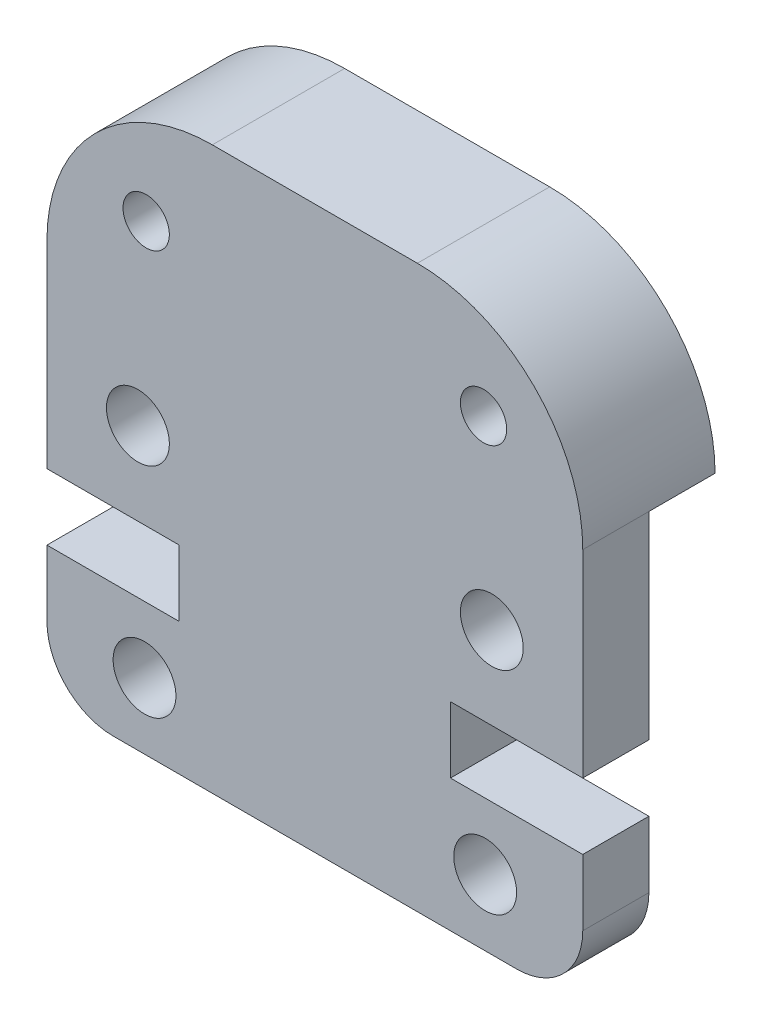
ISO-10303-21;
HEADER;
FILE_DESCRIPTION(('STEP AP214'),'2;1');
FILE_NAME('part.step','',(''),(''),'','','');
FILE_SCHEMA(('AUTOMOTIVE_DESIGN { 1 0 10303 214 1 1 1 1 }'));
ENDSEC;
DATA;
#1=APPLICATION_CONTEXT('core data for automotive mechanical design processes');
#2=APPLICATION_PROTOCOL_DEFINITION('international standard','automotive_design',2000,#1);
#3=PRODUCT_CONTEXT('',#1,'mechanical');
#4=PRODUCT('Part','Part','',(#3));
#5=PRODUCT_RELATED_PRODUCT_CATEGORY('part','',(#4));
#6=PRODUCT_DEFINITION_FORMATION('','',#4);
#7=PRODUCT_DEFINITION_CONTEXT('part definition',#1,'design');
#8=PRODUCT_DEFINITION('design','',#6,#7);
#9=PRODUCT_DEFINITION_SHAPE('','',#8);
#10=(LENGTH_UNIT() NAMED_UNIT(*) SI_UNIT(.MILLI.,.METRE.));
#11=(NAMED_UNIT(*) PLANE_ANGLE_UNIT() SI_UNIT($,.RADIAN.));
#12=(NAMED_UNIT(*) SI_UNIT($,.STERADIAN.) SOLID_ANGLE_UNIT());
#13=UNCERTAINTY_MEASURE_WITH_UNIT(LENGTH_MEASURE(1.E-05),#10,'distance_accuracy_value','');
#14=(GEOMETRIC_REPRESENTATION_CONTEXT(3) GLOBAL_UNCERTAINTY_ASSIGNED_CONTEXT((#13)) GLOBAL_UNIT_ASSIGNED_CONTEXT((#10,
#11,#12)) REPRESENTATION_CONTEXT('',''));
#15=CARTESIAN_POINT('',(0.,0.,0.));
#16=DIRECTION('',(0.,0.,1.));
#17=DIRECTION('',(1.,0.,0.));
#18=AXIS2_PLACEMENT_3D('',#15,#16,#17);
#19=CARTESIAN_POINT('',(-3.09999999999862,11.9799999999986,0.));
#20=DIRECTION('',(0.,0.,-1.));
#21=DIRECTION('',(-1.,0.,0.));
#22=AXIS2_PLACEMENT_3D('',#19,#20,#21);
#23=PLANE('',#22);
#24=CARTESIAN_POINT('',(-5.09999999999842,13.9799999999999,0.));
#25=DIRECTION('',(0.,0.,1.));
#26=DIRECTION('',(-1.,0.,0.));
#27=AXIS2_PLACEMENT_3D('',#24,#25,#26);
#28=CIRCLE('',#27,0.7);
#29=CARTESIAN_POINT('',(-5.79999999999843,13.9799999999999,0.));
#30=VERTEX_POINT('',#29);
#31=EDGE_CURVE('E276',#30,#30,#28,.T.);
#32=ORIENTED_EDGE('',*,*,#31,.T.);
#33=EDGE_LOOP('',(#32));
#34=FACE_BOUND('',#33,.T.);
#35=CARTESIAN_POINT('',(5.09999999999843,13.9799999999999,0.));
#36=DIRECTION('',(0.,0.,1.));
#37=DIRECTION('',(1.,0.,0.));
#38=AXIS2_PLACEMENT_3D('',#35,#36,#37);
#39=CIRCLE('',#38,0.699999999999999);
#40=CARTESIAN_POINT('',(5.79999999999843,13.9799999999999,0.));
#41=VERTEX_POINT('',#40);
#42=EDGE_CURVE('E264',#41,#41,#39,.T.);
#43=ORIENTED_EDGE('',*,*,#42,.T.);
#44=EDGE_LOOP('',(#43));
#45=FACE_BOUND('',#44,.T.);
#46=CARTESIAN_POINT('',(3.09999999999862,11.9799999999986,0.));
#47=DIRECTION('',(0.,0.,1.));
#48=DIRECTION('',(1.,0.,0.));
#49=AXIS2_PLACEMENT_3D('',#46,#47,#48);
#50=CIRCLE('',#49,5.00000000000135);
#51=CARTESIAN_POINT('',(8.09999999999997,11.9799999999986,0.));
#52=VERTEX_POINT('',#51);
#53=CARTESIAN_POINT('',(3.09999999999862,16.98,0.));
#54=VERTEX_POINT('',#53);
#55=EDGE_CURVE('E68',#52,#54,#50,.T.);
#56=ORIENTED_EDGE('',*,*,#55,.F.);
#57=DIRECTION('',(-1.,0.,0.));
#58=VECTOR('',#57,1.);
#59=CARTESIAN_POINT('',(8.09999999999997,11.9799999999986,0.));
#60=LINE('',#59,#58);
#61=CARTESIAN_POINT('',(-8.09999999999997,11.9799999999986,0.));
#62=VERTEX_POINT('',#61);
#63=EDGE_CURVE('E216',#52,#62,#60,.T.);
#64=ORIENTED_EDGE('',*,*,#63,.T.);
#65=CARTESIAN_POINT('',(-3.09999999999862,11.9799999999986,0.));
#66=DIRECTION('',(0.,0.,1.));
#67=DIRECTION('',(-1.,0.,0.));
#68=AXIS2_PLACEMENT_3D('',#65,#66,#67);
#69=CIRCLE('',#68,5.00000000000136);
#70=CARTESIAN_POINT('',(-3.09999999999862,16.98,0.));
#71=VERTEX_POINT('',#70);
#72=EDGE_CURVE('E149',#71,#62,#69,.T.);
#73=ORIENTED_EDGE('',*,*,#72,.F.);
#74=DIRECTION('',(-1.,0.,0.));
#75=VECTOR('',#74,1.);
#76=CARTESIAN_POINT('',(3.09999999999862,16.98,0.));
#77=LINE('',#76,#75);
#78=EDGE_CURVE('E74',#54,#71,#77,.T.);
#79=ORIENTED_EDGE('',*,*,#78,.F.);
#80=EDGE_LOOP('',(#56,#64,#73,#79));
#81=FACE_BOUND('',#80,.T.);
#82=ADVANCED_FACE('F35',(#34,#45,#81),#23,.T.);
#83=CARTESIAN_POINT('',(-3.09999999999862,11.9799999999986,4.));
#84=DIRECTION('',(0.,0.,-1.));
#85=DIRECTION('',(-1.,0.,0.));
#86=AXIS2_PLACEMENT_3D('',#83,#84,#85);
#87=PLANE('',#86);
#88=CARTESIAN_POINT('',(5.09999999999843,13.9799999999999,4.));
#89=DIRECTION('',(0.,0.,1.));
#90=DIRECTION('',(1.,0.,0.));
#91=AXIS2_PLACEMENT_3D('',#88,#89,#90);
#92=CIRCLE('',#91,0.699999999999999);
#93=CARTESIAN_POINT('',(5.79999999999843,13.9799999999999,4.));
#94=VERTEX_POINT('',#93);
#95=EDGE_CURVE('E265',#94,#94,#92,.T.);
#96=ORIENTED_EDGE('',*,*,#95,.F.);
#97=EDGE_LOOP('',(#96));
#98=FACE_BOUND('',#97,.T.);
#99=CARTESIAN_POINT('',(-5.34999999999997,8.50000000000221,4.));
#100=DIRECTION('',(0.,0.,1.));
#101=DIRECTION('',(-1.,0.,0.));
#102=AXIS2_PLACEMENT_3D('',#99,#100,#101);
#103=CIRCLE('',#102,0.95);
#104=CARTESIAN_POINT('',(-6.29999999999997,8.50000000000221,4.));
#105=VERTEX_POINT('',#104);
#106=EDGE_CURVE('E273',#105,#105,#103,.T.);
#107=ORIENTED_EDGE('',*,*,#106,.F.);
#108=EDGE_LOOP('',(#107));
#109=FACE_BOUND('',#108,.T.);
#110=CARTESIAN_POINT('',(-5.15,1.99999999999997,4.));
#111=DIRECTION('',(0.,0.,1.));
#112=DIRECTION('',(-1.,0.,0.));
#113=AXIS2_PLACEMENT_3D('',#110,#111,#112);
#114=CIRCLE('',#113,0.95);
#115=CARTESIAN_POINT('',(-6.1,1.99999999999997,4.));
#116=VERTEX_POINT('',#115);
#117=EDGE_CURVE('E152',#116,#116,#114,.T.);
#118=ORIENTED_EDGE('',*,*,#117,.F.);
#119=EDGE_LOOP('',(#118));
#120=FACE_BOUND('',#119,.T.);
#121=CARTESIAN_POINT('',(-3.09999999999862,11.9799999999986,4.));
#122=DIRECTION('',(0.,0.,1.));
#123=DIRECTION('',(-1.,0.,0.));
#124=AXIS2_PLACEMENT_3D('',#121,#122,#123);
#125=CIRCLE('',#124,5.00000000000136);
#126=CARTESIAN_POINT('',(-3.09999999999862,16.98,4.));
#127=VERTEX_POINT('',#126);
#128=CARTESIAN_POINT('',(-8.09999999999997,11.9799999999986,4.));
#129=VERTEX_POINT('',#128);
#130=EDGE_CURVE('E155',#127,#129,#125,.T.);
#131=ORIENTED_EDGE('',*,*,#130,.T.);
#132=DIRECTION('',(0.,-1.,0.));
#133=VECTOR('',#132,1.);
#134=CARTESIAN_POINT('',(-8.09999999999997,11.9799999999986,4.));
#135=LINE('',#134,#133);
#136=CARTESIAN_POINT('',(-8.09999999999997,5.99999999999993,4.));
#137=VERTEX_POINT('',#136);
#138=EDGE_CURVE('E82',#129,#137,#135,.T.);
#139=ORIENTED_EDGE('',*,*,#138,.T.);
#140=DIRECTION('',(1.,0.,0.));
#141=VECTOR('',#140,1.);
#142=CARTESIAN_POINT('',(-8.09999999999997,5.99999999999993,4.));
#143=LINE('',#142,#141);
#144=CARTESIAN_POINT('',(-4.10000000000002,5.99999999999993,4.));
#145=VERTEX_POINT('',#144);
#146=EDGE_CURVE('E198',#137,#145,#143,.T.);
#147=ORIENTED_EDGE('',*,*,#146,.T.);
#148=DIRECTION('',(0.,-1.,0.));
#149=VECTOR('',#148,1.);
#150=CARTESIAN_POINT('',(-4.10000000000002,5.99999999999993,4.));
#151=LINE('',#150,#149);
#152=CARTESIAN_POINT('',(-4.10000000000002,3.99999999999995,4.));
#153=VERTEX_POINT('',#152);
#154=EDGE_CURVE('E287',#145,#153,#151,.T.);
#155=ORIENTED_EDGE('',*,*,#154,.T.);
#156=DIRECTION('',(-1.,0.,0.));
#157=VECTOR('',#156,1.);
#158=CARTESIAN_POINT('',(-4.10000000000002,3.99999999999995,4.));
#159=LINE('',#158,#157);
#160=CARTESIAN_POINT('',(-8.09999999999997,3.99999999999995,4.));
#161=VERTEX_POINT('',#160);
#162=EDGE_CURVE('E289',#153,#161,#159,.T.);
#163=ORIENTED_EDGE('',*,*,#162,.T.);
#164=DIRECTION('',(0.,-1.,0.));
#165=VECTOR('',#164,1.);
#166=CARTESIAN_POINT('',(-8.09999999999997,1.99999999999997,4.));
#167=LINE('',#166,#165);
#168=CARTESIAN_POINT('',(-8.09999999999997,1.99999999999997,4.));
#169=VERTEX_POINT('',#168);
#170=EDGE_CURVE('E291',#161,#169,#167,.T.);
#171=ORIENTED_EDGE('',*,*,#170,.T.);
#172=CARTESIAN_POINT('',(-6.1,1.99999999999997,4.));
#173=DIRECTION('',(0.,0.,1.));
#174=DIRECTION('',(-1.,0.,0.));
#175=AXIS2_PLACEMENT_3D('',#172,#173,#174);
#176=CIRCLE('',#175,1.99999999999998);
#177=CARTESIAN_POINT('',(-6.09999999999999,0.,4.));
#178=VERTEX_POINT('',#177);
#179=EDGE_CURVE('E293',#169,#178,#176,.T.);
#180=ORIENTED_EDGE('',*,*,#179,.T.);
#181=DIRECTION('',(1.,0.,0.));
#182=VECTOR('',#181,1.);
#183=CARTESIAN_POINT('',(6.1,0.,4.));
#184=LINE('',#183,#182);
#185=CARTESIAN_POINT('',(6.1,0.,4.));
#186=VERTEX_POINT('',#185);
#187=EDGE_CURVE('E295',#178,#186,#184,.T.);
#188=ORIENTED_EDGE('',*,*,#187,.T.);
#189=CARTESIAN_POINT('',(6.1,1.99999999999998,4.));
#190=DIRECTION('',(0.,0.,1.));
#191=DIRECTION('',(1.,0.,0.));
#192=AXIS2_PLACEMENT_3D('',#189,#190,#191);
#193=CIRCLE('',#192,1.99999999999998);
#194=CARTESIAN_POINT('',(8.09999999999997,1.99999999999998,4.));
#195=VERTEX_POINT('',#194);
#196=EDGE_CURVE('E297',#186,#195,#193,.T.);
#197=ORIENTED_EDGE('',*,*,#196,.T.);
#198=DIRECTION('',(0.,1.,0.));
#199=VECTOR('',#198,1.);
#200=CARTESIAN_POINT('',(8.09999999999997,1.99999999999998,4.));
#201=LINE('',#200,#199);
#202=CARTESIAN_POINT('',(8.09999999999997,3.99999999999995,4.));
#203=VERTEX_POINT('',#202);
#204=EDGE_CURVE('E299',#195,#203,#201,.T.);
#205=ORIENTED_EDGE('',*,*,#204,.T.);
#206=DIRECTION('',(-1.,0.,0.));
#207=VECTOR('',#206,1.);
#208=CARTESIAN_POINT('',(4.10000000000002,3.99999999999995,4.));
#209=LINE('',#208,#207);
#210=CARTESIAN_POINT('',(4.10000000000002,3.99999999999995,4.));
#211=VERTEX_POINT('',#210);
#212=EDGE_CURVE('E301',#203,#211,#209,.T.);
#213=ORIENTED_EDGE('',*,*,#212,.T.);
#214=DIRECTION('',(0.,1.,0.));
#215=VECTOR('',#214,1.);
#216=CARTESIAN_POINT('',(4.10000000000002,5.99999999999993,4.));
#217=LINE('',#216,#215);
#218=CARTESIAN_POINT('',(4.10000000000002,5.99999999999993,4.));
#219=VERTEX_POINT('',#218);
#220=EDGE_CURVE('E303',#211,#219,#217,.T.);
#221=ORIENTED_EDGE('',*,*,#220,.T.);
#222=DIRECTION('',(1.,0.,0.));
#223=VECTOR('',#222,1.);
#224=CARTESIAN_POINT('',(8.09999999999997,5.99999999999993,4.));
#225=LINE('',#224,#223);
#226=CARTESIAN_POINT('',(8.09999999999997,5.99999999999993,4.));
#227=VERTEX_POINT('',#226);
#228=EDGE_CURVE('E128',#219,#227,#225,.T.);
#229=ORIENTED_EDGE('',*,*,#228,.T.);
#230=DIRECTION('',(0.,1.,0.));
#231=VECTOR('',#230,1.);
#232=CARTESIAN_POINT('',(8.09999999999997,11.9799999999986,4.));
#233=LINE('',#232,#231);
#234=CARTESIAN_POINT('',(8.09999999999997,11.9799999999986,4.));
#235=VERTEX_POINT('',#234);
#236=EDGE_CURVE('E121',#227,#235,#233,.T.);
#237=ORIENTED_EDGE('',*,*,#236,.T.);
#238=CARTESIAN_POINT('',(3.09999999999862,11.9799999999986,4.));
#239=DIRECTION('',(0.,0.,1.));
#240=DIRECTION('',(1.,0.,0.));
#241=AXIS2_PLACEMENT_3D('',#238,#239,#240);
#242=CIRCLE('',#241,5.00000000000135);
#243=CARTESIAN_POINT('',(3.09999999999862,16.98,4.));
#244=VERTEX_POINT('',#243);
#245=EDGE_CURVE('E126',#235,#244,#242,.T.);
#246=ORIENTED_EDGE('',*,*,#245,.T.);
#247=DIRECTION('',(-1.,0.,0.));
#248=VECTOR('',#247,1.);
#249=CARTESIAN_POINT('',(3.09999999999862,16.98,4.));
#250=LINE('',#249,#248);
#251=EDGE_CURVE('E53',#244,#127,#250,.T.);
#252=ORIENTED_EDGE('',*,*,#251,.T.);
#253=EDGE_LOOP('',(#131,#139,#147,#155,#163,#171,#180,#188,#197,#205,#213,#221,#229,#237,#246,#252));
#254=FACE_BOUND('',#253,.T.);
#255=CARTESIAN_POINT('',(-5.09999999999842,13.9799999999999,4.));
#256=DIRECTION('',(0.,0.,1.));
#257=DIRECTION('',(-1.,0.,0.));
#258=AXIS2_PLACEMENT_3D('',#255,#256,#257);
#259=CIRCLE('',#258,0.7);
#260=CARTESIAN_POINT('',(-5.79999999999843,13.9799999999999,4.));
#261=VERTEX_POINT('',#260);
#262=EDGE_CURVE('E277',#261,#261,#259,.T.);
#263=ORIENTED_EDGE('',*,*,#262,.F.);
#264=EDGE_LOOP('',(#263));
#265=FACE_BOUND('',#264,.T.);
#266=CARTESIAN_POINT('',(5.34999999999998,8.50000000000221,4.));
#267=DIRECTION('',(0.,0.,1.));
#268=DIRECTION('',(1.,0.,0.));
#269=AXIS2_PLACEMENT_3D('',#266,#267,#268);
#270=CIRCLE('',#269,0.95);
#271=CARTESIAN_POINT('',(6.29999999999998,8.50000000000221,4.));
#272=VERTEX_POINT('',#271);
#273=EDGE_CURVE('E268',#272,#272,#270,.T.);
#274=ORIENTED_EDGE('',*,*,#273,.F.);
#275=EDGE_LOOP('',(#274));
#276=FACE_BOUND('',#275,.T.);
#277=CARTESIAN_POINT('',(5.15,1.99999999999998,4.));
#278=DIRECTION('',(0.,0.,1.));
#279=DIRECTION('',(1.,0.,0.));
#280=AXIS2_PLACEMENT_3D('',#277,#278,#279);
#281=CIRCLE('',#280,0.95);
#282=CARTESIAN_POINT('',(6.1,1.99999999999998,4.));
#283=VERTEX_POINT('',#282);
#284=EDGE_CURVE('E261',#283,#283,#281,.T.);
#285=ORIENTED_EDGE('',*,*,#284,.F.);
#286=EDGE_LOOP('',(#285));
#287=FACE_BOUND('',#286,.T.);
#288=ADVANCED_FACE('F123',(#98,#109,#120,#254,#265,#276,#287),#87,.F.);
#289=CARTESIAN_POINT('',(-3.09999999999862,11.9799999999986,4.));
#290=DIRECTION('',(0.,0.,-1.));
#291=DIRECTION('',(-1.,0.,0.));
#292=AXIS2_PLACEMENT_3D('',#289,#290,#291);
#293=CYLINDRICAL_SURFACE('',#292,5.00000000000136);
#294=ORIENTED_EDGE('',*,*,#72,.T.);
#295=DIRECTION('',(0.,0.,-1.));
#296=VECTOR('',#295,1.);
#297=CARTESIAN_POINT('',(-8.09999999999997,11.9799999999986,2.));
#298=LINE('',#297,#296);
#299=CARTESIAN_POINT('',(-8.09999999999997,11.9799999999986,2.));
#300=VERTEX_POINT('',#299);
#301=EDGE_CURVE('E223',#300,#62,#298,.T.);
#302=ORIENTED_EDGE('',*,*,#301,.F.);
#303=DIRECTION('',(0.,0.,-1.));
#304=VECTOR('',#303,1.);
#305=CARTESIAN_POINT('',(-8.09999999999997,11.9799999999986,4.));
#306=LINE('',#305,#304);
#307=EDGE_CURVE('E11',#129,#300,#306,.T.);
#308=ORIENTED_EDGE('',*,*,#307,.F.);
#309=ORIENTED_EDGE('',*,*,#130,.F.);
#310=DIRECTION('',(0.,0.,-1.));
#311=VECTOR('',#310,1.);
#312=CARTESIAN_POINT('',(-3.09999999999862,16.98,4.));
#313=LINE('',#312,#311);
#314=EDGE_CURVE('E145',#127,#71,#313,.T.);
#315=ORIENTED_EDGE('',*,*,#314,.T.);
#316=EDGE_LOOP('',(#294,#302,#308,#309,#315));
#317=FACE_BOUND('',#316,.T.);
#318=ADVANCED_FACE('F37',(#317),#293,.T.);
#319=CARTESIAN_POINT('',(-8.09999999999997,11.9799999999986,4.));
#320=DIRECTION('',(1.,0.,0.));
#321=DIRECTION('',(0.,1.,0.));
#322=AXIS2_PLACEMENT_3D('',#319,#320,#321);
#323=PLANE('',#322);
#324=ORIENTED_EDGE('',*,*,#307,.T.);
#325=DIRECTION('',(0.,-1.,0.));
#326=VECTOR('',#325,1.);
#327=CARTESIAN_POINT('',(-8.09999999999997,11.9799999999986,2.));
#328=LINE('',#327,#326);
#329=CARTESIAN_POINT('',(-8.09999999999997,5.99999999999993,2.));
#330=VERTEX_POINT('',#329);
#331=EDGE_CURVE('E205',#300,#330,#328,.T.);
#332=ORIENTED_EDGE('',*,*,#331,.T.);
#333=DIRECTION('',(0.,0.,-1.));
#334=VECTOR('',#333,1.);
#335=CARTESIAN_POINT('',(-8.09999999999997,5.99999999999993,4.));
#336=LINE('',#335,#334);
#337=EDGE_CURVE('E45',#137,#330,#336,.T.);
#338=ORIENTED_EDGE('',*,*,#337,.F.);
#339=ORIENTED_EDGE('',*,*,#138,.F.);
#340=EDGE_LOOP('',(#324,#332,#338,#339));
#341=FACE_BOUND('',#340,.T.);
#342=ADVANCED_FACE('F203',(#341),#323,.F.);
#343=CARTESIAN_POINT('',(-8.09999999999997,5.99999999999993,4.));
#344=DIRECTION('',(0.,1.,0.));
#345=DIRECTION('',(-1.,0.,0.));
#346=AXIS2_PLACEMENT_3D('',#343,#344,#345);
#347=PLANE('',#346);
#348=ORIENTED_EDGE('',*,*,#337,.T.);
#349=DIRECTION('',(1.,0.,0.));
#350=VECTOR('',#349,1.);
#351=CARTESIAN_POINT('',(-8.09999999999997,5.99999999999993,2.));
#352=LINE('',#351,#350);
#353=CARTESIAN_POINT('',(-4.10000000000002,5.99999999999993,2.));
#354=VERTEX_POINT('',#353);
#355=EDGE_CURVE('E197',#330,#354,#352,.T.);
#356=ORIENTED_EDGE('',*,*,#355,.T.);
#357=DIRECTION('',(0.,0.,-1.));
#358=VECTOR('',#357,1.);
#359=CARTESIAN_POINT('',(-4.10000000000002,5.99999999999993,4.));
#360=LINE('',#359,#358);
#361=EDGE_CURVE('E186',#145,#354,#360,.T.);
#362=ORIENTED_EDGE('',*,*,#361,.F.);
#363=ORIENTED_EDGE('',*,*,#146,.F.);
#364=EDGE_LOOP('',(#348,#356,#362,#363));
#365=FACE_BOUND('',#364,.T.);
#366=ADVANCED_FACE('F194',(#365),#347,.F.);
#367=CARTESIAN_POINT('',(-4.10000000000002,5.99999999999993,4.));
#368=DIRECTION('',(1.,0.,0.));
#369=DIRECTION('',(0.,0.,-1.));
#370=AXIS2_PLACEMENT_3D('',#367,#368,#369);
#371=PLANE('',#370);
#372=ORIENTED_EDGE('',*,*,#361,.T.);
#373=DIRECTION('',(0.,-1.,0.));
#374=VECTOR('',#373,1.);
#375=CARTESIAN_POINT('',(-4.10000000000002,5.99999999999993,2.));
#376=LINE('',#375,#374);
#377=CARTESIAN_POINT('',(-4.10000000000002,3.99999999999995,2.));
#378=VERTEX_POINT('',#377);
#379=EDGE_CURVE('E257',#354,#378,#376,.T.);
#380=ORIENTED_EDGE('',*,*,#379,.T.);
#381=DIRECTION('',(0.,0.,-1.));
#382=VECTOR('',#381,1.);
#383=CARTESIAN_POINT('',(-4.10000000000002,3.99999999999995,4.));
#384=LINE('',#383,#382);
#385=EDGE_CURVE('E183',#153,#378,#384,.T.);
#386=ORIENTED_EDGE('',*,*,#385,.F.);
#387=ORIENTED_EDGE('',*,*,#154,.F.);
#388=EDGE_LOOP('',(#372,#380,#386,#387));
#389=FACE_BOUND('',#388,.T.);
#390=ADVANCED_FACE('F332',(#389),#371,.F.);
#391=CARTESIAN_POINT('',(-4.10000000000002,3.99999999999995,4.));
#392=DIRECTION('',(0.,-1.,0.));
#393=DIRECTION('',(1.,0.,0.));
#394=AXIS2_PLACEMENT_3D('',#391,#392,#393);
#395=PLANE('',#394);
#396=ORIENTED_EDGE('',*,*,#385,.T.);
#397=DIRECTION('',(-1.,0.,0.));
#398=VECTOR('',#397,1.);
#399=CARTESIAN_POINT('',(-4.10000000000002,3.99999999999995,2.));
#400=LINE('',#399,#398);
#401=CARTESIAN_POINT('',(-8.09999999999997,3.99999999999995,2.));
#402=VERTEX_POINT('',#401);
#403=EDGE_CURVE('E254',#378,#402,#400,.T.);
#404=ORIENTED_EDGE('',*,*,#403,.T.);
#405=DIRECTION('',(0.,0.,-1.));
#406=VECTOR('',#405,1.);
#407=CARTESIAN_POINT('',(-8.09999999999997,3.99999999999995,4.));
#408=LINE('',#407,#406);
#409=EDGE_CURVE('E180',#161,#402,#408,.T.);
#410=ORIENTED_EDGE('',*,*,#409,.F.);
#411=ORIENTED_EDGE('',*,*,#162,.F.);
#412=EDGE_LOOP('',(#396,#404,#410,#411));
#413=FACE_BOUND('',#412,.T.);
#414=ADVANCED_FACE('F336',(#413),#395,.F.);
#415=CARTESIAN_POINT('',(-8.09999999999997,1.99999999999997,4.));
#416=DIRECTION('',(1.,0.,0.));
#417=DIRECTION('',(0.,0.,-1.));
#418=AXIS2_PLACEMENT_3D('',#415,#416,#417);
#419=PLANE('',#418);
#420=ORIENTED_EDGE('',*,*,#409,.T.);
#421=CARTESIAN_POINT('',(-8.09999999999997,1.99999999999997,2.));
#422=VERTEX_POINT('',#421);
#423=EDGE_CURVE('E211',#402,#422,#328,.T.);
#424=ORIENTED_EDGE('',*,*,#423,.T.);
#425=DIRECTION('',(0.,0.,-1.));
#426=VECTOR('',#425,1.);
#427=CARTESIAN_POINT('',(-8.09999999999997,1.99999999999997,4.));
#428=LINE('',#427,#426);
#429=EDGE_CURVE('E177',#169,#422,#428,.T.);
#430=ORIENTED_EDGE('',*,*,#429,.F.);
#431=ORIENTED_EDGE('',*,*,#170,.F.);
#432=EDGE_LOOP('',(#420,#424,#430,#431));
#433=FACE_BOUND('',#432,.T.);
#434=ADVANCED_FACE('F392',(#433),#419,.F.);
#435=CARTESIAN_POINT('',(-6.1,1.99999999999997,4.));
#436=DIRECTION('',(0.,0.,-1.));
#437=DIRECTION('',(-1.,0.,0.));
#438=AXIS2_PLACEMENT_3D('',#435,#436,#437);
#439=CYLINDRICAL_SURFACE('',#438,1.99999999999998);
#440=ORIENTED_EDGE('',*,*,#429,.T.);
#441=CARTESIAN_POINT('',(-6.1,1.99999999999997,2.));
#442=DIRECTION('',(0.,0.,1.));
#443=DIRECTION('',(1.,0.,0.));
#444=AXIS2_PLACEMENT_3D('',#441,#442,#443);
#445=CIRCLE('',#444,1.99999999999998);
#446=CARTESIAN_POINT('',(-6.09999999999999,0.,2.));
#447=VERTEX_POINT('',#446);
#448=EDGE_CURVE('E251',#422,#447,#445,.T.);
#449=ORIENTED_EDGE('',*,*,#448,.T.);
#450=DIRECTION('',(0.,0.,-1.));
#451=VECTOR('',#450,1.);
#452=CARTESIAN_POINT('',(-6.09999999999999,0.,4.));
#453=LINE('',#452,#451);
#454=EDGE_CURVE('E174',#178,#447,#453,.T.);
#455=ORIENTED_EDGE('',*,*,#454,.F.);
#456=ORIENTED_EDGE('',*,*,#179,.F.);
#457=EDGE_LOOP('',(#440,#449,#455,#456));
#458=FACE_BOUND('',#457,.T.);
#459=ADVANCED_FACE('F388',(#458),#439,.T.);
#460=CARTESIAN_POINT('',(6.1,0.,4.));
#461=DIRECTION('',(0.,1.,0.));
#462=DIRECTION('',(-1.,0.,0.));
#463=AXIS2_PLACEMENT_3D('',#460,#461,#462);
#464=PLANE('',#463);
#465=ORIENTED_EDGE('',*,*,#454,.T.);
#466=DIRECTION('',(1.,0.,0.));
#467=VECTOR('',#466,1.);
#468=CARTESIAN_POINT('',(-8.09999999999997,0.,2.));
#469=LINE('',#468,#467);
#470=CARTESIAN_POINT('',(6.1,0.,2.));
#471=VERTEX_POINT('',#470);
#472=EDGE_CURVE('E210',#447,#471,#469,.T.);
#473=ORIENTED_EDGE('',*,*,#472,.T.);
#474=DIRECTION('',(0.,0.,-1.));
#475=VECTOR('',#474,1.);
#476=CARTESIAN_POINT('',(6.1,0.,4.));
#477=LINE('',#476,#475);
#478=EDGE_CURVE('E171',#186,#471,#477,.T.);
#479=ORIENTED_EDGE('',*,*,#478,.F.);
#480=ORIENTED_EDGE('',*,*,#187,.F.);
#481=EDGE_LOOP('',(#465,#473,#479,#480));
#482=FACE_BOUND('',#481,.T.);
#483=ADVANCED_FACE('F384',(#482),#464,.F.);
#484=CARTESIAN_POINT('',(6.1,1.99999999999998,4.));
#485=DIRECTION('',(0.,0.,-1.));
#486=DIRECTION('',(-1.,0.,0.));
#487=AXIS2_PLACEMENT_3D('',#484,#485,#486);
#488=CYLINDRICAL_SURFACE('',#487,1.99999999999998);
#489=ORIENTED_EDGE('',*,*,#478,.T.);
#490=CARTESIAN_POINT('',(6.1,1.99999999999998,2.));
#491=DIRECTION('',(0.,0.,1.));
#492=DIRECTION('',(1.,0.,0.));
#493=AXIS2_PLACEMENT_3D('',#490,#491,#492);
#494=CIRCLE('',#493,1.99999999999998);
#495=CARTESIAN_POINT('',(8.09999999999997,1.99999999999998,2.));
#496=VERTEX_POINT('',#495);
#497=EDGE_CURVE('E248',#471,#496,#494,.T.);
#498=ORIENTED_EDGE('',*,*,#497,.T.);
#499=DIRECTION('',(0.,0.,-1.));
#500=VECTOR('',#499,1.);
#501=CARTESIAN_POINT('',(8.09999999999997,1.99999999999998,4.));
#502=LINE('',#501,#500);
#503=EDGE_CURVE('E168',#195,#496,#502,.T.);
#504=ORIENTED_EDGE('',*,*,#503,.F.);
#505=ORIENTED_EDGE('',*,*,#196,.F.);
#506=EDGE_LOOP('',(#489,#498,#504,#505));
#507=FACE_BOUND('',#506,.T.);
#508=ADVANCED_FACE('F380',(#507),#488,.T.);
#509=CARTESIAN_POINT('',(8.09999999999997,1.99999999999998,4.));
#510=DIRECTION('',(-1.,0.,0.));
#511=DIRECTION('',(0.,0.,1.));
#512=AXIS2_PLACEMENT_3D('',#509,#510,#511);
#513=PLANE('',#512);
#514=ORIENTED_EDGE('',*,*,#503,.T.);
#515=DIRECTION('',(0.,1.,0.));
#516=VECTOR('',#515,1.);
#517=CARTESIAN_POINT('',(8.09999999999997,0.,2.));
#518=LINE('',#517,#516);
#519=CARTESIAN_POINT('',(8.09999999999997,3.99999999999995,2.));
#520=VERTEX_POINT('',#519);
#521=EDGE_CURVE('E219',#496,#520,#518,.T.);
#522=ORIENTED_EDGE('',*,*,#521,.T.);
#523=DIRECTION('',(0.,0.,-1.));
#524=VECTOR('',#523,1.);
#525=CARTESIAN_POINT('',(8.09999999999997,3.99999999999995,4.));
#526=LINE('',#525,#524);
#527=EDGE_CURVE('E165',#203,#520,#526,.T.);
#528=ORIENTED_EDGE('',*,*,#527,.F.);
#529=ORIENTED_EDGE('',*,*,#204,.F.);
#530=EDGE_LOOP('',(#514,#522,#528,#529));
#531=FACE_BOUND('',#530,.T.);
#532=ADVANCED_FACE('F376',(#531),#513,.F.);
#533=CARTESIAN_POINT('',(4.10000000000002,3.99999999999995,4.));
#534=DIRECTION('',(0.,-1.,0.));
#535=DIRECTION('',(0.,0.,-1.));
#536=AXIS2_PLACEMENT_3D('',#533,#534,#535);
#537=PLANE('',#536);
#538=ORIENTED_EDGE('',*,*,#527,.T.);
#539=DIRECTION('',(-1.,0.,0.));
#540=VECTOR('',#539,1.);
#541=CARTESIAN_POINT('',(4.10000000000002,3.99999999999995,2.));
#542=LINE('',#541,#540);
#543=CARTESIAN_POINT('',(4.10000000000002,3.99999999999995,2.));
#544=VERTEX_POINT('',#543);
#545=EDGE_CURVE('E245',#520,#544,#542,.T.);
#546=ORIENTED_EDGE('',*,*,#545,.T.);
#547=DIRECTION('',(0.,0.,-1.));
#548=VECTOR('',#547,1.);
#549=CARTESIAN_POINT('',(4.10000000000002,3.99999999999995,4.));
#550=LINE('',#549,#548);
#551=EDGE_CURVE('E162',#211,#544,#550,.T.);
#552=ORIENTED_EDGE('',*,*,#551,.F.);
#553=ORIENTED_EDGE('',*,*,#212,.F.);
#554=EDGE_LOOP('',(#538,#546,#552,#553));
#555=FACE_BOUND('',#554,.T.);
#556=ADVANCED_FACE('F373',(#555),#537,.F.);
#557=CARTESIAN_POINT('',(4.10000000000002,5.99999999999993,4.));
#558=DIRECTION('',(-1.,0.,0.));
#559=DIRECTION('',(0.,0.,1.));
#560=AXIS2_PLACEMENT_3D('',#557,#558,#559);
#561=PLANE('',#560);
#562=ORIENTED_EDGE('',*,*,#551,.T.);
#563=DIRECTION('',(0.,1.,0.));
#564=VECTOR('',#563,1.);
#565=CARTESIAN_POINT('',(4.10000000000002,5.99999999999993,2.));
#566=LINE('',#565,#564);
#567=CARTESIAN_POINT('',(4.10000000000002,5.99999999999993,2.));
#568=VERTEX_POINT('',#567);
#569=EDGE_CURVE('E242',#544,#568,#566,.T.);
#570=ORIENTED_EDGE('',*,*,#569,.T.);
#571=DIRECTION('',(0.,0.,-1.));
#572=VECTOR('',#571,1.);
#573=CARTESIAN_POINT('',(4.10000000000002,5.99999999999993,4.));
#574=LINE('',#573,#572);
#575=EDGE_CURVE('E159',#219,#568,#574,.T.);
#576=ORIENTED_EDGE('',*,*,#575,.F.);
#577=ORIENTED_EDGE('',*,*,#220,.F.);
#578=EDGE_LOOP('',(#562,#570,#576,#577));
#579=FACE_BOUND('',#578,.T.);
#580=ADVANCED_FACE('F309',(#579),#561,.F.);
#581=CARTESIAN_POINT('',(8.09999999999997,5.99999999999993,4.));
#582=DIRECTION('',(0.,1.,0.));
#583=DIRECTION('',(0.,0.,1.));
#584=AXIS2_PLACEMENT_3D('',#581,#582,#583);
#585=PLANE('',#584);
#586=ORIENTED_EDGE('',*,*,#575,.T.);
#587=DIRECTION('',(1.,0.,0.));
#588=VECTOR('',#587,1.);
#589=CARTESIAN_POINT('',(8.09999999999997,5.99999999999993,2.));
#590=LINE('',#589,#588);
#591=CARTESIAN_POINT('',(8.09999999999997,5.99999999999993,2.));
#592=VERTEX_POINT('',#591);
#593=EDGE_CURVE('E239',#568,#592,#590,.T.);
#594=ORIENTED_EDGE('',*,*,#593,.T.);
#595=DIRECTION('',(0.,0.,-1.));
#596=VECTOR('',#595,1.);
#597=CARTESIAN_POINT('',(8.09999999999997,5.99999999999993,4.));
#598=LINE('',#597,#596);
#599=EDGE_CURVE('E140',#227,#592,#598,.T.);
#600=ORIENTED_EDGE('',*,*,#599,.F.);
#601=ORIENTED_EDGE('',*,*,#228,.F.);
#602=EDGE_LOOP('',(#586,#594,#600,#601));
#603=FACE_BOUND('',#602,.T.);
#604=ADVANCED_FACE('F313',(#603),#585,.F.);
#605=CARTESIAN_POINT('',(8.09999999999997,11.9799999999986,4.));
#606=DIRECTION('',(-1.,0.,0.));
#607=DIRECTION('',(0.,0.,1.));
#608=AXIS2_PLACEMENT_3D('',#605,#606,#607);
#609=PLANE('',#608);
#610=ORIENTED_EDGE('',*,*,#599,.T.);
#611=CARTESIAN_POINT('',(8.09999999999997,11.9799999999986,2.));
#612=VERTEX_POINT('',#611);
#613=EDGE_CURVE('E139',#592,#612,#518,.T.);
#614=ORIENTED_EDGE('',*,*,#613,.T.);
#615=DIRECTION('',(0.,0.,-1.));
#616=VECTOR('',#615,1.);
#617=CARTESIAN_POINT('',(8.09999999999997,11.9799999999986,4.));
#618=LINE('',#617,#616);
#619=EDGE_CURVE('E135',#235,#612,#618,.T.);
#620=ORIENTED_EDGE('',*,*,#619,.F.);
#621=ORIENTED_EDGE('',*,*,#236,.F.);
#622=EDGE_LOOP('',(#610,#614,#620,#621));
#623=FACE_BOUND('',#622,.T.);
#624=ADVANCED_FACE('F136',(#623),#609,.F.);
#625=CARTESIAN_POINT('',(3.09999999999862,11.9799999999986,4.));
#626=DIRECTION('',(0.,0.,-1.));
#627=DIRECTION('',(-1.,0.,0.));
#628=AXIS2_PLACEMENT_3D('',#625,#626,#627);
#629=CYLINDRICAL_SURFACE('',#628,5.00000000000135);
#630=ORIENTED_EDGE('',*,*,#55,.T.);
#631=DIRECTION('',(0.,0.,-1.));
#632=VECTOR('',#631,1.);
#633=CARTESIAN_POINT('',(3.09999999999862,16.98,4.));
#634=LINE('',#633,#632);
#635=EDGE_CURVE('E141',#244,#54,#634,.T.);
#636=ORIENTED_EDGE('',*,*,#635,.F.);
#637=ORIENTED_EDGE('',*,*,#245,.F.);
#638=ORIENTED_EDGE('',*,*,#619,.T.);
#639=DIRECTION('',(0.,0.,-1.));
#640=VECTOR('',#639,1.);
#641=CARTESIAN_POINT('',(8.09999999999997,11.9799999999986,2.));
#642=LINE('',#641,#640);
#643=EDGE_CURVE('E228',#612,#52,#642,.T.);
#644=ORIENTED_EDGE('',*,*,#643,.T.);
#645=EDGE_LOOP('',(#630,#636,#637,#638,#644));
#646=FACE_BOUND('',#645,.T.);
#647=ADVANCED_FACE('F143',(#646),#629,.T.);
#648=CARTESIAN_POINT('',(3.09999999999862,16.98,4.));
#649=DIRECTION('',(0.,-1.,0.));
#650=DIRECTION('',(0.,0.,-1.));
#651=AXIS2_PLACEMENT_3D('',#648,#649,#650);
#652=PLANE('',#651);
#653=ORIENTED_EDGE('',*,*,#78,.T.);
#654=ORIENTED_EDGE('',*,*,#314,.F.);
#655=ORIENTED_EDGE('',*,*,#251,.F.);
#656=ORIENTED_EDGE('',*,*,#635,.T.);
#657=EDGE_LOOP('',(#653,#654,#655,#656));
#658=FACE_BOUND('',#657,.T.);
#659=ADVANCED_FACE('F361',(#658),#652,.F.);
#660=CARTESIAN_POINT('',(-5.15,1.99999999999997,4.));
#661=DIRECTION('',(0.,0.,-1.));
#662=DIRECTION('',(-1.,0.,0.));
#663=AXIS2_PLACEMENT_3D('',#660,#661,#662);
#664=CYLINDRICAL_SURFACE('',#663,0.95);
#665=CARTESIAN_POINT('',(-5.15,1.99999999999997,2.));
#666=DIRECTION('',(0.,0.,1.));
#667=DIRECTION('',(1.,0.,0.));
#668=AXIS2_PLACEMENT_3D('',#665,#666,#667);
#669=CIRCLE('',#668,0.95);
#670=CARTESIAN_POINT('',(-4.2,1.99999999999997,2.));
#671=VERTEX_POINT('',#670);
#672=EDGE_CURVE('E236',#671,#671,#669,.T.);
#673=ORIENTED_EDGE('',*,*,#672,.F.);
#674=EDGE_LOOP('',(#673));
#675=FACE_BOUND('',#674,.T.);
#676=ORIENTED_EDGE('',*,*,#117,.T.);
#677=EDGE_LOOP('',(#676));
#678=FACE_BOUND('',#677,.T.);
#679=ADVANCED_FACE('F364',(#675,#678),#664,.F.);
#680=CARTESIAN_POINT('',(-5.09999999999842,13.9799999999999,4.));
#681=DIRECTION('',(0.,0.,-1.));
#682=DIRECTION('',(-1.,0.,0.));
#683=AXIS2_PLACEMENT_3D('',#680,#681,#682);
#684=CYLINDRICAL_SURFACE('',#683,0.7);
#685=ORIENTED_EDGE('',*,*,#262,.T.);
#686=EDGE_LOOP('',(#685));
#687=FACE_BOUND('',#686,.T.);
#688=ORIENTED_EDGE('',*,*,#31,.F.);
#689=EDGE_LOOP('',(#688));
#690=FACE_BOUND('',#689,.T.);
#691=ADVANCED_FACE('F426',(#687,#690),#684,.F.);
#692=CARTESIAN_POINT('',(-5.34999999999997,8.50000000000221,4.));
#693=DIRECTION('',(0.,0.,-1.));
#694=DIRECTION('',(-1.,0.,0.));
#695=AXIS2_PLACEMENT_3D('',#692,#693,#694);
#696=CYLINDRICAL_SURFACE('',#695,0.95);
#697=CARTESIAN_POINT('',(-5.34999999999997,8.50000000000221,2.));
#698=DIRECTION('',(0.,0.,1.));
#699=DIRECTION('',(1.,0.,0.));
#700=AXIS2_PLACEMENT_3D('',#697,#698,#699);
#701=CIRCLE('',#700,0.95);
#702=CARTESIAN_POINT('',(-4.39999999999997,8.50000000000221,2.));
#703=VERTEX_POINT('',#702);
#704=EDGE_CURVE('E233',#703,#703,#701,.T.);
#705=ORIENTED_EDGE('',*,*,#704,.F.);
#706=EDGE_LOOP('',(#705));
#707=FACE_BOUND('',#706,.T.);
#708=ORIENTED_EDGE('',*,*,#106,.T.);
#709=EDGE_LOOP('',(#708));
#710=FACE_BOUND('',#709,.T.);
#711=ADVANCED_FACE('F431',(#707,#710),#696,.F.);
#712=CARTESIAN_POINT('',(5.34999999999998,8.50000000000221,4.));
#713=DIRECTION('',(0.,0.,-1.));
#714=DIRECTION('',(-1.,0.,0.));
#715=AXIS2_PLACEMENT_3D('',#712,#713,#714);
#716=CYLINDRICAL_SURFACE('',#715,0.95);
#717=CARTESIAN_POINT('',(5.34999999999998,8.50000000000221,2.));
#718=DIRECTION('',(0.,0.,1.));
#719=DIRECTION('',(1.,0.,0.));
#720=AXIS2_PLACEMENT_3D('',#717,#718,#719);
#721=CIRCLE('',#720,0.95);
#722=CARTESIAN_POINT('',(6.29999999999998,8.50000000000221,2.));
#723=VERTEX_POINT('',#722);
#724=EDGE_CURVE('E230',#723,#723,#721,.T.);
#725=ORIENTED_EDGE('',*,*,#724,.F.);
#726=EDGE_LOOP('',(#725));
#727=FACE_BOUND('',#726,.T.);
#728=ORIENTED_EDGE('',*,*,#273,.T.);
#729=EDGE_LOOP('',(#728));
#730=FACE_BOUND('',#729,.T.);
#731=ADVANCED_FACE('F444',(#727,#730),#716,.F.);
#732=CARTESIAN_POINT('',(5.09999999999843,13.9799999999999,4.));
#733=DIRECTION('',(0.,0.,-1.));
#734=DIRECTION('',(-1.,0.,0.));
#735=AXIS2_PLACEMENT_3D('',#732,#733,#734);
#736=CYLINDRICAL_SURFACE('',#735,0.699999999999999);
#737=ORIENTED_EDGE('',*,*,#95,.T.);
#738=EDGE_LOOP('',(#737));
#739=FACE_BOUND('',#738,.T.);
#740=ORIENTED_EDGE('',*,*,#42,.F.);
#741=EDGE_LOOP('',(#740));
#742=FACE_BOUND('',#741,.T.);
#743=ADVANCED_FACE('F439',(#739,#742),#736,.F.);
#744=CARTESIAN_POINT('',(5.15,1.99999999999998,4.));
#745=DIRECTION('',(0.,0.,-1.));
#746=DIRECTION('',(-1.,0.,0.));
#747=AXIS2_PLACEMENT_3D('',#744,#745,#746);
#748=CYLINDRICAL_SURFACE('',#747,0.95);
#749=CARTESIAN_POINT('',(5.15,1.99999999999998,2.));
#750=DIRECTION('',(0.,0.,1.));
#751=DIRECTION('',(1.,0.,0.));
#752=AXIS2_PLACEMENT_3D('',#749,#750,#751);
#753=CIRCLE('',#752,0.95);
#754=CARTESIAN_POINT('',(6.1,1.99999999999998,2.));
#755=VERTEX_POINT('',#754);
#756=EDGE_CURVE('E39',#755,#755,#753,.T.);
#757=ORIENTED_EDGE('',*,*,#756,.F.);
#758=EDGE_LOOP('',(#757));
#759=FACE_BOUND('',#758,.T.);
#760=ORIENTED_EDGE('',*,*,#284,.T.);
#761=EDGE_LOOP('',(#760));
#762=FACE_BOUND('',#761,.T.);
#763=ADVANCED_FACE('F443',(#759,#762),#748,.F.);
#764=CARTESIAN_POINT('',(0.,0.,2.));
#765=DIRECTION('',(0.,0.,1.));
#766=DIRECTION('',(1.,0.,0.));
#767=AXIS2_PLACEMENT_3D('',#764,#765,#766);
#768=PLANE('',#767);
#769=ORIENTED_EDGE('',*,*,#672,.T.);
#770=EDGE_LOOP('',(#769));
#771=FACE_BOUND('',#770,.T.);
#772=ORIENTED_EDGE('',*,*,#704,.T.);
#773=EDGE_LOOP('',(#772));
#774=FACE_BOUND('',#773,.T.);
#775=ORIENTED_EDGE('',*,*,#724,.T.);
#776=EDGE_LOOP('',(#775));
#777=FACE_BOUND('',#776,.T.);
#778=ORIENTED_EDGE('',*,*,#756,.T.);
#779=EDGE_LOOP('',(#778));
#780=FACE_BOUND('',#779,.T.);
#781=ORIENTED_EDGE('',*,*,#331,.F.);
#782=DIRECTION('',(-1.,0.,0.));
#783=VECTOR('',#782,1.);
#784=CARTESIAN_POINT('',(8.09999999999997,11.9799999999986,2.));
#785=LINE('',#784,#783);
#786=EDGE_CURVE('E220',#612,#300,#785,.T.);
#787=ORIENTED_EDGE('',*,*,#786,.F.);
#788=ORIENTED_EDGE('',*,*,#613,.F.);
#789=ORIENTED_EDGE('',*,*,#593,.F.);
#790=ORIENTED_EDGE('',*,*,#569,.F.);
#791=ORIENTED_EDGE('',*,*,#545,.F.);
#792=ORIENTED_EDGE('',*,*,#521,.F.);
#793=ORIENTED_EDGE('',*,*,#497,.F.);
#794=ORIENTED_EDGE('',*,*,#472,.F.);
#795=ORIENTED_EDGE('',*,*,#448,.F.);
#796=ORIENTED_EDGE('',*,*,#423,.F.);
#797=ORIENTED_EDGE('',*,*,#403,.F.);
#798=ORIENTED_EDGE('',*,*,#379,.F.);
#799=ORIENTED_EDGE('',*,*,#355,.F.);
#800=EDGE_LOOP('',(#781,#787,#788,#789,#790,#791,#792,#793,#794,#795,#796,#797,#798,#799));
#801=FACE_BOUND('',#800,.T.);
#802=ADVANCED_FACE('F329',(#771,#774,#777,#780,#801),#768,.F.);
#803=CARTESIAN_POINT('',(8.09999999999997,11.9799999999986,2.));
#804=DIRECTION('',(0.,-1.,0.));
#805=DIRECTION('',(1.,0.,0.));
#806=AXIS2_PLACEMENT_3D('',#803,#804,#805);
#807=PLANE('',#806);
#808=ORIENTED_EDGE('',*,*,#63,.F.);
#809=ORIENTED_EDGE('',*,*,#643,.F.);
#810=ORIENTED_EDGE('',*,*,#786,.T.);
#811=ORIENTED_EDGE('',*,*,#301,.T.);
#812=EDGE_LOOP('',(#808,#809,#810,#811));
#813=FACE_BOUND('',#812,.T.);
#814=ADVANCED_FACE('F346',(#813),#807,.T.);
#815=CLOSED_SHELL('',(#82,#288,#318,#342,#366,#390,#414,#434,#459,#483,#508,#532,#556,#580,#604,
#624,#647,#659,#679,#691,#711,#731,#743,#763,#802,#814));
#816=MANIFOLD_SOLID_BREP('B2',#815);
#817=ADVANCED_BREP_SHAPE_REPRESENTATION('',(#18,#816),#14);
#818=SHAPE_DEFINITION_REPRESENTATION(#9,#817);
ENDSEC;
END-ISO-10303-21;
